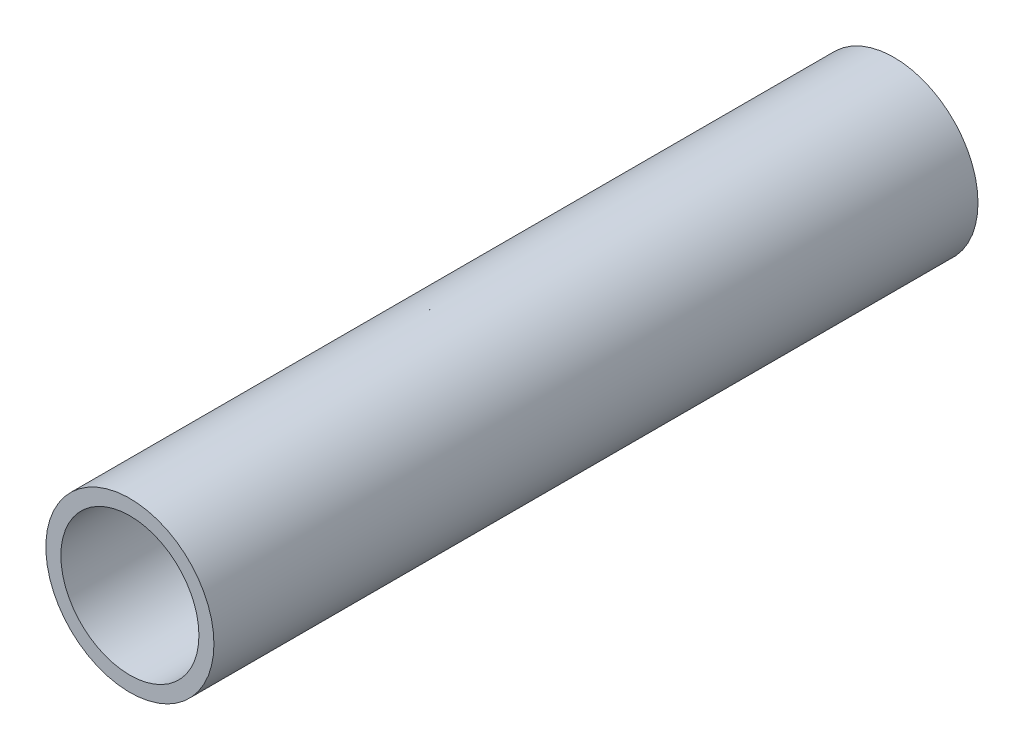
ISO-10303-21;
HEADER;
FILE_DESCRIPTION(('STEP AP214'),'2;1');
FILE_NAME('part.step','',(''),(''),'','','');
FILE_SCHEMA(('AUTOMOTIVE_DESIGN { 1 0 10303 214 1 1 1 1 }'));
ENDSEC;
DATA;
#1=APPLICATION_CONTEXT('core data for automotive mechanical design processes');
#2=APPLICATION_PROTOCOL_DEFINITION('international standard','automotive_design',2000,#1);
#3=PRODUCT_CONTEXT('',#1,'mechanical');
#4=PRODUCT('Part','Part','',(#3));
#5=PRODUCT_RELATED_PRODUCT_CATEGORY('part','',(#4));
#6=PRODUCT_DEFINITION_FORMATION('','',#4);
#7=PRODUCT_DEFINITION_CONTEXT('part definition',#1,'design');
#8=PRODUCT_DEFINITION('design','',#6,#7);
#9=PRODUCT_DEFINITION_SHAPE('','',#8);
#10=(LENGTH_UNIT() NAMED_UNIT(*) SI_UNIT(.MILLI.,.METRE.));
#11=(NAMED_UNIT(*) PLANE_ANGLE_UNIT() SI_UNIT($,.RADIAN.));
#12=(NAMED_UNIT(*) SI_UNIT($,.STERADIAN.) SOLID_ANGLE_UNIT());
#13=UNCERTAINTY_MEASURE_WITH_UNIT(LENGTH_MEASURE(1.E-05),#10,'distance_accuracy_value','');
#14=(GEOMETRIC_REPRESENTATION_CONTEXT(3) GLOBAL_UNCERTAINTY_ASSIGNED_CONTEXT((#13)) GLOBAL_UNIT_ASSIGNED_CONTEXT((#10,
#11,#12)) REPRESENTATION_CONTEXT('',''));
#15=CARTESIAN_POINT('',(0.,0.,0.));
#16=DIRECTION('',(0.,0.,1.));
#17=DIRECTION('',(1.,0.,0.));
#18=AXIS2_PLACEMENT_3D('',#15,#16,#17);
#19=CARTESIAN_POINT('',(0.,0.,25.4));
#20=DIRECTION('',(0.,0.,-1.));
#21=DIRECTION('',(-1.,0.,0.));
#22=AXIS2_PLACEMENT_3D('',#19,#20,#21);
#23=CYLINDRICAL_SURFACE('',#22,2.295);
#24=CARTESIAN_POINT('',(0.,0.,25.4));
#25=DIRECTION('',(0.,0.,1.));
#26=DIRECTION('',(1.,0.,0.));
#27=AXIS2_PLACEMENT_3D('',#24,#25,#26);
#28=CIRCLE('',#27,2.295);
#29=CARTESIAN_POINT('',(2.295,0.,25.4));
#30=VERTEX_POINT('',#29);
#31=EDGE_CURVE('E56',#30,#30,#28,.T.);
#32=ORIENTED_EDGE('',*,*,#31,.T.);
#33=EDGE_LOOP('',(#32));
#34=FACE_BOUND('',#33,.T.);
#35=CARTESIAN_POINT('',(0.,0.,9.652));
#36=DIRECTION('',(0.,0.,-1.));
#37=DIRECTION('',(-1.,0.,0.));
#38=AXIS2_PLACEMENT_3D('',#35,#36,#37);
#39=CIRCLE('',#38,2.295);
#40=CARTESIAN_POINT('',(-2.295,0.,9.652));
#41=VERTEX_POINT('',#40);
#42=EDGE_CURVE('E62',#41,#41,#39,.T.);
#43=ORIENTED_EDGE('',*,*,#42,.T.);
#44=EDGE_LOOP('',(#43));
#45=FACE_BOUND('',#44,.T.);
#46=ADVANCED_FACE('F37',(#34,#45),#23,.F.);
#47=CARTESIAN_POINT('',(0.,0.,25.4));
#48=DIRECTION('',(0.,0.,1.));
#49=DIRECTION('',(1.,0.,0.));
#50=AXIS2_PLACEMENT_3D('',#47,#48,#49);
#51=PLANE('',#50);
#52=CARTESIAN_POINT('',(0.,0.,25.4));
#53=DIRECTION('',(0.,0.,1.));
#54=DIRECTION('',(1.,0.,0.));
#55=AXIS2_PLACEMENT_3D('',#52,#53,#54);
#56=CIRCLE('',#55,2.794);
#57=CARTESIAN_POINT('',(2.794,0.,25.4));
#58=VERTEX_POINT('',#57);
#59=EDGE_CURVE('E45',#58,#58,#56,.T.);
#60=ORIENTED_EDGE('',*,*,#59,.T.);
#61=EDGE_LOOP('',(#60));
#62=FACE_BOUND('',#61,.T.);
#63=ORIENTED_EDGE('',*,*,#31,.F.);
#64=EDGE_LOOP('',(#63));
#65=FACE_BOUND('',#64,.T.);
#66=ADVANCED_FACE('F97',(#62,#65),#51,.T.);
#67=CARTESIAN_POINT('',(0.,0.,0.));
#68=DIRECTION('',(0.,0.,1.));
#69=DIRECTION('',(1.,0.,0.));
#70=AXIS2_PLACEMENT_3D('',#67,#68,#69);
#71=PLANE('',#70);
#72=CARTESIAN_POINT('',(0.,0.,0.));
#73=DIRECTION('',(0.,0.,1.));
#74=DIRECTION('',(1.,0.,0.));
#75=AXIS2_PLACEMENT_3D('',#72,#73,#74);
#76=CIRCLE('',#75,2.794);
#77=CARTESIAN_POINT('',(2.794,0.,0.));
#78=VERTEX_POINT('',#77);
#79=EDGE_CURVE('E50',#78,#78,#76,.T.);
#80=ORIENTED_EDGE('',*,*,#79,.F.);
#81=EDGE_LOOP('',(#80));
#82=FACE_BOUND('',#81,.T.);
#83=CARTESIAN_POINT('',(0.,0.,0.));
#84=DIRECTION('',(0.,0.,1.));
#85=DIRECTION('',(1.,0.,0.));
#86=AXIS2_PLACEMENT_3D('',#83,#84,#85);
#87=CIRCLE('',#86,2.295);
#88=CARTESIAN_POINT('',(2.295,0.,0.));
#89=VERTEX_POINT('',#88);
#90=EDGE_CURVE('E58',#89,#89,#87,.T.);
#91=ORIENTED_EDGE('',*,*,#90,.T.);
#92=EDGE_LOOP('',(#91));
#93=FACE_BOUND('',#92,.T.);
#94=ADVANCED_FACE('F103',(#82,#93),#71,.F.);
#95=CARTESIAN_POINT('',(0.,0.,25.4));
#96=DIRECTION('',(0.,0.,-1.));
#97=DIRECTION('',(-1.,0.,0.));
#98=AXIS2_PLACEMENT_3D('',#95,#96,#97);
#99=CYLINDRICAL_SURFACE('',#98,2.794);
#100=ORIENTED_EDGE('',*,*,#59,.F.);
#101=EDGE_LOOP('',(#100));
#102=FACE_BOUND('',#101,.T.);
#103=ORIENTED_EDGE('',*,*,#79,.T.);
#104=EDGE_LOOP('',(#103));
#105=FACE_BOUND('',#104,.T.);
#106=ADVANCED_FACE('F39',(#102,#105),#99,.T.);
#107=CARTESIAN_POINT('',(0.,0.,9.017));
#108=DIRECTION('',(0.,0.,-1.));
#109=DIRECTION('',(-1.,0.,0.));
#110=AXIS2_PLACEMENT_3D('',#107,#108,#109);
#111=CIRCLE('',#110,2.295);
#112=CARTESIAN_POINT('',(-2.295,0.,9.017));
#113=VERTEX_POINT('',#112);
#114=EDGE_CURVE('E10',#113,#113,#111,.T.);
#115=ORIENTED_EDGE('',*,*,#114,.F.);
#116=EDGE_LOOP('',(#115));
#117=FACE_BOUND('',#116,.T.);
#118=ORIENTED_EDGE('',*,*,#90,.F.);
#119=EDGE_LOOP('',(#118));
#120=FACE_BOUND('',#119,.T.);
#121=ADVANCED_FACE('F84',(#117,#120),#23,.F.);
#122=CARTESIAN_POINT('',(0.,0.,9.017));
#123=DIRECTION('',(0.,0.,-1.));
#124=DIRECTION('',(-1.,0.,0.));
#125=AXIS2_PLACEMENT_3D('',#122,#123,#124);
#126=PLANE('',#125);
#127=ORIENTED_EDGE('',*,*,#114,.T.);
#128=EDGE_LOOP('',(#127));
#129=FACE_BOUND('',#128,.T.);
#130=CARTESIAN_POINT('',(0.,0.,9.017));
#131=DIRECTION('',(0.,0.,-1.));
#132=DIRECTION('',(-1.,0.,0.));
#133=AXIS2_PLACEMENT_3D('',#130,#131,#132);
#134=CIRCLE('',#133,1.778);
#135=CARTESIAN_POINT('',(-1.778,0.,9.017));
#136=VERTEX_POINT('',#135);
#137=EDGE_CURVE('E69',#136,#136,#134,.T.);
#138=ORIENTED_EDGE('',*,*,#137,.F.);
#139=EDGE_LOOP('',(#138));
#140=FACE_BOUND('',#139,.T.);
#141=ADVANCED_FACE('F81',(#129,#140),#126,.T.);
#142=CARTESIAN_POINT('',(0.,0.,9.652));
#143=DIRECTION('',(0.,0.,-1.));
#144=DIRECTION('',(-1.,0.,0.));
#145=AXIS2_PLACEMENT_3D('',#142,#143,#144);
#146=PLANE('',#145);
#147=ORIENTED_EDGE('',*,*,#42,.F.);
#148=EDGE_LOOP('',(#147));
#149=FACE_BOUND('',#148,.T.);
#150=CARTESIAN_POINT('',(0.,0.,9.652));
#151=DIRECTION('',(0.,0.,-1.));
#152=DIRECTION('',(-1.,0.,0.));
#153=AXIS2_PLACEMENT_3D('',#150,#151,#152);
#154=CIRCLE('',#153,1.778);
#155=CARTESIAN_POINT('',(-1.778,0.,9.652));
#156=VERTEX_POINT('',#155);
#157=EDGE_CURVE('E70',#156,#156,#154,.T.);
#158=ORIENTED_EDGE('',*,*,#157,.T.);
#159=EDGE_LOOP('',(#158));
#160=FACE_BOUND('',#159,.T.);
#161=ADVANCED_FACE('F83',(#149,#160),#146,.F.);
#162=CARTESIAN_POINT('',(0.,0.,9.017));
#163=DIRECTION('',(0.,0.,1.));
#164=DIRECTION('',(1.,0.,0.));
#165=AXIS2_PLACEMENT_3D('',#162,#163,#164);
#166=CYLINDRICAL_SURFACE('',#165,1.778);
#167=ORIENTED_EDGE('',*,*,#137,.T.);
#168=EDGE_LOOP('',(#167));
#169=FACE_BOUND('',#168,.T.);
#170=ORIENTED_EDGE('',*,*,#157,.F.);
#171=EDGE_LOOP('',(#170));
#172=FACE_BOUND('',#171,.T.);
#173=ADVANCED_FACE('F78',(#169,#172),#166,.F.);
#174=CLOSED_SHELL('',(#46,#66,#94,#106,#121,#141,#161,#173));
#175=MANIFOLD_SOLID_BREP('B2',#174);
#176=ADVANCED_BREP_SHAPE_REPRESENTATION('',(#18,#175),#14);
#177=SHAPE_DEFINITION_REPRESENTATION(#9,#176);
ENDSEC;
END-ISO-10303-21;
